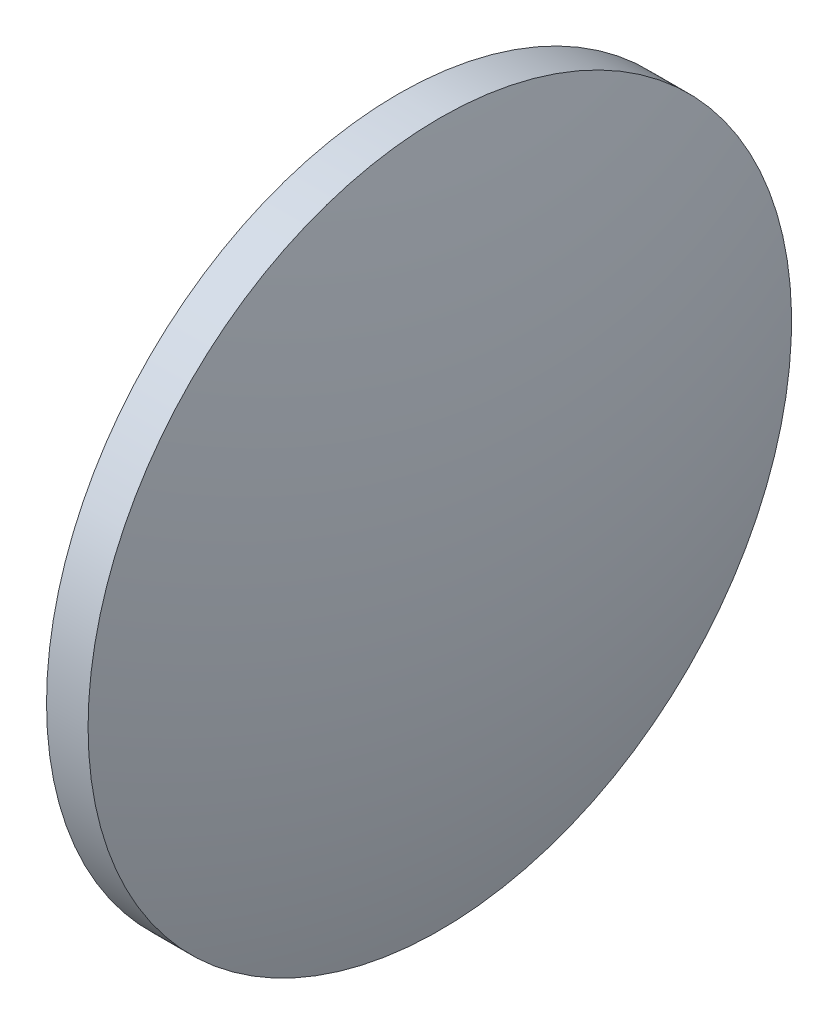
ISO-10303-21;
HEADER;
FILE_DESCRIPTION(('STEP AP214'),'2;1');
FILE_NAME('part.step','',(''),(''),'','','');
FILE_SCHEMA(('AUTOMOTIVE_DESIGN { 1 0 10303 214 1 1 1 1 }'));
ENDSEC;
DATA;
#1=APPLICATION_CONTEXT('core data for automotive mechanical design processes');
#2=APPLICATION_PROTOCOL_DEFINITION('international standard','automotive_design',2000,#1);
#3=PRODUCT_CONTEXT('',#1,'mechanical');
#4=PRODUCT('Part','Part','',(#3));
#5=PRODUCT_RELATED_PRODUCT_CATEGORY('part','',(#4));
#6=PRODUCT_DEFINITION_FORMATION('','',#4);
#7=PRODUCT_DEFINITION_CONTEXT('part definition',#1,'design');
#8=PRODUCT_DEFINITION('design','',#6,#7);
#9=PRODUCT_DEFINITION_SHAPE('','',#8);
#10=(LENGTH_UNIT() NAMED_UNIT(*) SI_UNIT(.MILLI.,.METRE.));
#11=(NAMED_UNIT(*) PLANE_ANGLE_UNIT() SI_UNIT($,.RADIAN.));
#12=(NAMED_UNIT(*) SI_UNIT($,.STERADIAN.) SOLID_ANGLE_UNIT());
#13=UNCERTAINTY_MEASURE_WITH_UNIT(LENGTH_MEASURE(1.E-05),#10,'distance_accuracy_value','');
#14=(GEOMETRIC_REPRESENTATION_CONTEXT(3) GLOBAL_UNCERTAINTY_ASSIGNED_CONTEXT((#13)) GLOBAL_UNIT_ASSIGNED_CONTEXT((#10,
#11,#12)) REPRESENTATION_CONTEXT('',''));
#15=CARTESIAN_POINT('',(0.,0.,0.));
#16=DIRECTION('',(0.,0.,1.));
#17=DIRECTION('',(1.,0.,0.));
#18=AXIS2_PLACEMENT_3D('',#15,#16,#17);
#19=CARTESIAN_POINT('',(257.969088414045,97.2322260463696,0.));
#20=DIRECTION('',(-1.,0.,0.));
#21=DIRECTION('',(0.,1.,0.));
#22=AXIS2_PLACEMENT_3D('',#19,#20,#21);
#23=SPHERICAL_SURFACE('',#22,90.2026960075769);
#24=CARTESIAN_POINT('',(171.416408692182,97.2322260463696,0.));
#25=DIRECTION('',(-1.,0.,0.));
#26=DIRECTION('',(0.,0.,1.));
#27=AXIS2_PLACEMENT_3D('',#24,#25,#26);
#28=CIRCLE('',#27,25.4);
#29=CARTESIAN_POINT('',(171.416408692182,97.2322260463696,25.4));
#30=VERTEX_POINT('',#29);
#31=EDGE_CURVE('E41',#30,#30,#28,.T.);
#32=ORIENTED_EDGE('',*,*,#31,.T.);
#33=EDGE_LOOP('',(#32));
#34=FACE_BOUND('',#33,.T.);
#35=ADVANCED_FACE('F35',(#34),#23,.T.);
#36=CARTESIAN_POINT('',(87.863686684601,97.2322260463686,0.));
#37=DIRECTION('',(-1.,0.,0.));
#38=DIRECTION('',(0.,1.,0.));
#39=AXIS2_PLACEMENT_3D('',#36,#37,#38);
#40=SPHERICAL_SURFACE('',#39,90.202696007581);
#41=CARTESIAN_POINT('',(174.416366406468,97.2322260463696,0.));
#42=DIRECTION('',(-1.,0.,0.));
#43=DIRECTION('',(0.,0.,1.));
#44=AXIS2_PLACEMENT_3D('',#41,#42,#43);
#45=CIRCLE('',#44,25.4);
#46=CARTESIAN_POINT('',(174.416366406468,97.2322260463696,25.4));
#47=VERTEX_POINT('',#46);
#48=EDGE_CURVE('E10',#47,#47,#45,.T.);
#49=ORIENTED_EDGE('',*,*,#48,.F.);
#50=EDGE_LOOP('',(#49));
#51=FACE_BOUND('',#50,.T.);
#52=ADVANCED_FACE('F50',(#51),#40,.T.);
#53=CARTESIAN_POINT('',(165.744107942151,97.2322260463696,0.));
#54=DIRECTION('',(-1.,0.,0.));
#55=DIRECTION('',(0.,0.,1.));
#56=AXIS2_PLACEMENT_3D('',#53,#54,#55);
#57=CYLINDRICAL_SURFACE('',#56,25.4);
#58=ORIENTED_EDGE('',*,*,#48,.T.);
#59=EDGE_LOOP('',(#58));
#60=FACE_BOUND('',#59,.T.);
#61=ORIENTED_EDGE('',*,*,#31,.F.);
#62=EDGE_LOOP('',(#61));
#63=FACE_BOUND('',#62,.T.);
#64=ADVANCED_FACE('F48',(#60,#63),#57,.T.);
#65=CLOSED_SHELL('',(#35,#52,#64));
#66=MANIFOLD_SOLID_BREP('B2',#65);
#67=ADVANCED_BREP_SHAPE_REPRESENTATION('',(#18,#66),#14);
#68=SHAPE_DEFINITION_REPRESENTATION(#9,#67);
ENDSEC;
END-ISO-10303-21;
